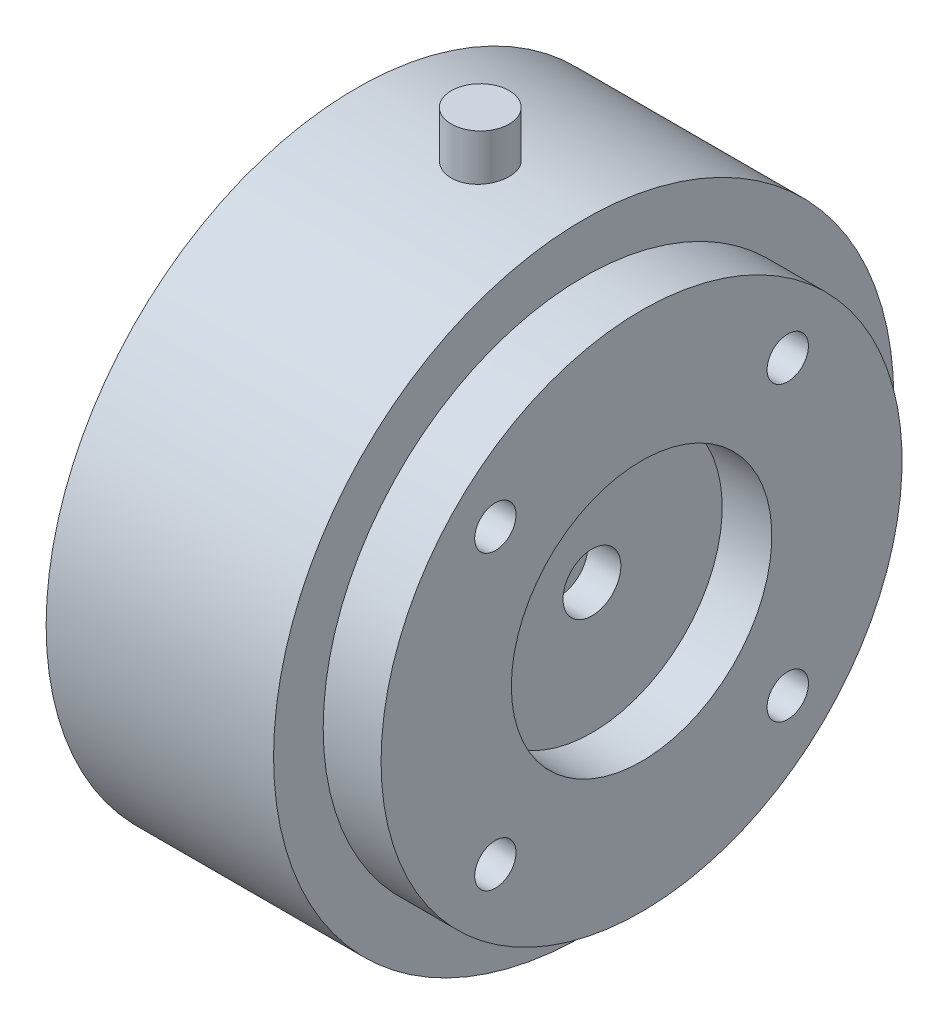
ISO-10303-21;
HEADER;
FILE_DESCRIPTION(('STEP AP214'),'2;1');
FILE_NAME('part.step','',(''),(''),'','','');
FILE_SCHEMA(('AUTOMOTIVE_DESIGN { 1 0 10303 214 1 1 1 1 }'));
ENDSEC;
DATA;
#1=APPLICATION_CONTEXT('core data for automotive mechanical design processes');
#2=APPLICATION_PROTOCOL_DEFINITION('international standard','automotive_design',2000,#1);
#3=PRODUCT_CONTEXT('',#1,'mechanical');
#4=PRODUCT('Part','Part','',(#3));
#5=PRODUCT_RELATED_PRODUCT_CATEGORY('part','',(#4));
#6=PRODUCT_DEFINITION_FORMATION('','',#4);
#7=PRODUCT_DEFINITION_CONTEXT('part definition',#1,'design');
#8=PRODUCT_DEFINITION('design','',#6,#7);
#9=PRODUCT_DEFINITION_SHAPE('','',#8);
#10=(LENGTH_UNIT() NAMED_UNIT(*) SI_UNIT(.MILLI.,.METRE.));
#11=(NAMED_UNIT(*) PLANE_ANGLE_UNIT() SI_UNIT($,.RADIAN.));
#12=(NAMED_UNIT(*) SI_UNIT($,.STERADIAN.) SOLID_ANGLE_UNIT());
#13=UNCERTAINTY_MEASURE_WITH_UNIT(LENGTH_MEASURE(1.E-05),#10,'distance_accuracy_value','');
#14=(GEOMETRIC_REPRESENTATION_CONTEXT(3) GLOBAL_UNCERTAINTY_ASSIGNED_CONTEXT((#13)) GLOBAL_UNIT_ASSIGNED_CONTEXT((#10,
#11,#12)) REPRESENTATION_CONTEXT('',''));
#15=CARTESIAN_POINT('',(0.,0.,0.));
#16=DIRECTION('',(0.,0.,1.));
#17=DIRECTION('',(1.,0.,0.));
#18=AXIS2_PLACEMENT_3D('',#15,#16,#17);
#19=CARTESIAN_POINT('',(24.5,0.,0.));
#20=DIRECTION('',(1.,0.,0.));
#21=DIRECTION('',(0.,0.,-1.));
#22=AXIS2_PLACEMENT_3D('',#19,#20,#21);
#23=PLANE('',#22);
#24=CARTESIAN_POINT('',(24.5,0.,0.));
#25=DIRECTION('',(1.,0.,0.));
#26=DIRECTION('',(0.,0.,-1.));
#27=AXIS2_PLACEMENT_3D('',#24,#25,#26);
#28=CIRCLE('',#27,3.5);
#29=CARTESIAN_POINT('',(24.5,0.,-3.5));
#30=VERTEX_POINT('',#29);
#31=EDGE_CURVE('P0_E385',#30,#30,#28,.T.);
#32=ORIENTED_EDGE('',*,*,#31,.T.);
#33=EDGE_LOOP('',(#32));
#34=FACE_BOUND('',#33,.T.);
#35=ADVANCED_FACE('P0_F17',(#34),#23,.T.);
#36=CARTESIAN_POINT('',(0.,0.,0.));
#37=DIRECTION('',(1.,0.,0.));
#38=DIRECTION('',(0.,0.,-1.));
#39=AXIS2_PLACEMENT_3D('',#36,#37,#38);
#40=CYLINDRICAL_SURFACE('',#39,3.5);
#41=ORIENTED_EDGE('',*,*,#31,.F.);
#42=EDGE_LOOP('',(#41));
#43=FACE_BOUND('',#42,.T.);
#44=CARTESIAN_POINT('',(28.5,0.,0.));
#45=DIRECTION('',(1.,0.,0.));
#46=DIRECTION('',(0.,0.,-1.));
#47=AXIS2_PLACEMENT_3D('',#44,#45,#46);
#48=CIRCLE('',#47,3.5);
#49=CARTESIAN_POINT('',(28.5,0.,-3.5));
#50=VERTEX_POINT('',#49);
#51=EDGE_CURVE('P0_E386',#50,#50,#48,.T.);
#52=ORIENTED_EDGE('',*,*,#51,.T.);
#53=EDGE_LOOP('',(#52));
#54=FACE_BOUND('',#53,.T.);
#55=ADVANCED_FACE('P0_F350',(#43,#54),#40,.F.);
#56=CARTESIAN_POINT('',(28.5,15.75,0.));
#57=DIRECTION('',(-1.,0.,0.));
#58=DIRECTION('',(0.,0.,1.));
#59=AXIS2_PLACEMENT_3D('',#56,#57,#58);
#60=PLANE('',#59);
#61=ORIENTED_EDGE('',*,*,#51,.F.);
#62=EDGE_LOOP('',(#61));
#63=FACE_BOUND('',#62,.T.);
#64=CARTESIAN_POINT('',(28.5,0.,0.));
#65=DIRECTION('',(-1.,0.,0.));
#66=DIRECTION('',(0.,0.,1.));
#67=AXIS2_PLACEMENT_3D('',#64,#65,#66);
#68=CIRCLE('',#67,15.75);
#69=CARTESIAN_POINT('',(28.5,0.,15.75));
#70=VERTEX_POINT('',#69);
#71=EDGE_CURVE('P0_E85',#70,#70,#68,.F.);
#72=ORIENTED_EDGE('',*,*,#71,.T.);
#73=EDGE_LOOP('',(#72));
#74=FACE_BOUND('',#73,.T.);
#75=ADVANCED_FACE('P0_F342',(#63,#74),#60,.F.);
#76=CARTESIAN_POINT('',(26.4999999999418,17.6776695296637,-17.6776695296637));
#77=DIRECTION('',(1.,0.,0.));
#78=DIRECTION('',(0.,0.,-1.));
#79=AXIS2_PLACEMENT_3D('',#76,#77,#78);
#80=CONICAL_SURFACE('',#79,2.49999999979603,1.02974425839346);
#81=CARTESIAN_POINT('',(24.9978484518465,17.6776695296637,-17.67766952955));
#82=VERTEX_POINT('',#81);
#83=VERTEX_LOOP('',#82);
#84=FACE_BOUND('',#83,.T.);
#85=CARTESIAN_POINT('',(26.5,17.6776695296637,-17.6776695296637));
#86=DIRECTION('',(1.,0.,0.));
#87=DIRECTION('',(0.,0.,-1.));
#88=AXIS2_PLACEMENT_3D('',#85,#86,#87);
#89=CIRCLE('',#88,2.5);
#90=CARTESIAN_POINT('',(26.5,17.6776695296637,-20.1776695296637));
#91=VERTEX_POINT('',#90);
#92=EDGE_CURVE('P0_E83',#91,#91,#89,.T.);
#93=ORIENTED_EDGE('',*,*,#92,.T.);
#94=EDGE_LOOP('',(#93));
#95=FACE_BOUND('',#94,.T.);
#96=ADVANCED_FACE('P0_F334',(#84,#95),#80,.F.);
#97=CARTESIAN_POINT('',(26.4999999999418,17.6776695296637,17.6776695296637));
#98=DIRECTION('',(1.,0.,0.));
#99=DIRECTION('',(0.,0.,-1.));
#100=AXIS2_PLACEMENT_3D('',#97,#98,#99);
#101=CONICAL_SURFACE('',#100,2.49999999997205,1.02974425866283);
#102=CARTESIAN_POINT('',(24.9978484523581,17.6776695296637,17.6776695295473));
#103=VERTEX_POINT('',#102);
#104=VERTEX_LOOP('',#103);
#105=FACE_BOUND('',#104,.T.);
#106=CARTESIAN_POINT('',(26.5,17.6776695296637,17.6776695296637));
#107=DIRECTION('',(1.,0.,0.));
#108=DIRECTION('',(0.,0.,-1.));
#109=AXIS2_PLACEMENT_3D('',#106,#107,#108);
#110=CIRCLE('',#109,2.5);
#111=CARTESIAN_POINT('',(26.5,17.6776695296637,15.1776695296637));
#112=VERTEX_POINT('',#111);
#113=EDGE_CURVE('P0_E80',#112,#112,#110,.T.);
#114=ORIENTED_EDGE('',*,*,#113,.T.);
#115=EDGE_LOOP('',(#114));
#116=FACE_BOUND('',#115,.T.);
#117=ADVANCED_FACE('P0_F325',(#105,#116),#101,.F.);
#118=CARTESIAN_POINT('',(26.4999999999418,-17.6776695296638,17.6776695296636));
#119=DIRECTION('',(1.,0.,0.));
#120=DIRECTION('',(0.,1.,0.));
#121=AXIS2_PLACEMENT_3D('',#118,#119,#120);
#122=CONICAL_SURFACE('',#121,2.4999999999721,1.02974425866285);
#123=CARTESIAN_POINT('',(24.9978484523581,-17.6776695296638,17.6776695296636));
#124=VERTEX_POINT('',#123);
#125=VERTEX_LOOP('',#124);
#126=FACE_BOUND('',#125,.T.);
#127=CARTESIAN_POINT('',(26.5,-17.6776695296638,17.6776695296636));
#128=DIRECTION('',(1.,0.,0.));
#129=DIRECTION('',(0.,0.,-1.));
#130=AXIS2_PLACEMENT_3D('',#127,#128,#129);
#131=CIRCLE('',#130,2.5);
#132=CARTESIAN_POINT('',(26.5,-17.6776695296638,15.1776695296636));
#133=VERTEX_POINT('',#132);
#134=EDGE_CURVE('P0_E77',#133,#133,#131,.T.);
#135=ORIENTED_EDGE('',*,*,#134,.T.);
#136=EDGE_LOOP('',(#135));
#137=FACE_BOUND('',#136,.T.);
#138=ADVANCED_FACE('P0_F317',(#126,#137),#122,.F.);
#139=CARTESIAN_POINT('',(26.4999999999418,-17.6776695296635,-17.6776695296638));
#140=DIRECTION('',(1.,0.,0.));
#141=DIRECTION('',(0.,0.,-1.));
#142=AXIS2_PLACEMENT_3D('',#139,#140,#141);
#143=CONICAL_SURFACE('',#142,2.49999999979592,1.02974425851373);
#144=CARTESIAN_POINT('',(24.9978484521876,-17.6776695296635,-17.6776695295786));
#145=VERTEX_POINT('',#144);
#146=VERTEX_LOOP('',#145);
#147=FACE_BOUND('',#146,.T.);
#148=CARTESIAN_POINT('',(26.5,-17.6776695296635,-17.6776695296638));
#149=DIRECTION('',(1.,0.,0.));
#150=DIRECTION('',(0.,0.,-1.));
#151=AXIS2_PLACEMENT_3D('',#148,#149,#150);
#152=CIRCLE('',#151,2.5);
#153=CARTESIAN_POINT('',(26.5,-17.6776695296635,-20.1776695296638));
#154=VERTEX_POINT('',#153);
#155=EDGE_CURVE('P0_E73',#154,#154,#152,.T.);
#156=ORIENTED_EDGE('',*,*,#155,.T.);
#157=EDGE_LOOP('',(#156));
#158=FACE_BOUND('',#157,.T.);
#159=ADVANCED_FACE('P0_F308',(#147,#158),#143,.F.);
#160=CARTESIAN_POINT('',(0.,0.,0.));
#161=DIRECTION('',(-1.,0.,0.));
#162=DIRECTION('',(0.,0.,1.));
#163=AXIS2_PLACEMENT_3D('',#160,#161,#162);
#164=CYLINDRICAL_SURFACE('',#163,15.75);
#165=ORIENTED_EDGE('',*,*,#71,.F.);
#166=EDGE_LOOP('',(#165));
#167=FACE_BOUND('',#166,.T.);
#168=CARTESIAN_POINT('',(34.5,0.,0.));
#169=DIRECTION('',(-1.,0.,0.));
#170=DIRECTION('',(0.,0.,1.));
#171=AXIS2_PLACEMENT_3D('',#168,#169,#170);
#172=CIRCLE('',#171,15.75);
#173=CARTESIAN_POINT('',(34.5,0.,15.75));
#174=VERTEX_POINT('',#173);
#175=EDGE_CURVE('P0_E76',#174,#174,#172,.F.);
#176=ORIENTED_EDGE('',*,*,#175,.T.);
#177=EDGE_LOOP('',(#176));
#178=FACE_BOUND('',#177,.T.);
#179=ADVANCED_FACE('P0_F299',(#167,#178),#164,.F.);
#180=CARTESIAN_POINT('',(34.5,17.6776695296637,-17.6776695296637));
#181=DIRECTION('',(1.,0.,0.));
#182=DIRECTION('',(0.,0.,-1.));
#183=AXIS2_PLACEMENT_3D('',#180,#181,#182);
#184=CYLINDRICAL_SURFACE('',#183,2.5);
#185=ORIENTED_EDGE('',*,*,#92,.F.);
#186=EDGE_LOOP('',(#185));
#187=FACE_BOUND('',#186,.T.);
#188=CARTESIAN_POINT('',(34.5,17.6776695296637,-17.6776695296637));
#189=DIRECTION('',(1.,0.,0.));
#190=DIRECTION('',(0.,0.,-1.));
#191=AXIS2_PLACEMENT_3D('',#188,#189,#190);
#192=CIRCLE('',#191,2.5);
#193=CARTESIAN_POINT('',(34.5,17.6776695296637,-20.1776695296637));
#194=VERTEX_POINT('',#193);
#195=EDGE_CURVE('P0_E402',#194,#194,#192,.T.);
#196=ORIENTED_EDGE('',*,*,#195,.T.);
#197=EDGE_LOOP('',(#196));
#198=FACE_BOUND('',#197,.T.);
#199=ADVANCED_FACE('P0_F290',(#187,#198),#184,.F.);
#200=CARTESIAN_POINT('',(34.5,17.6776695296637,17.6776695296637));
#201=DIRECTION('',(1.,0.,0.));
#202=DIRECTION('',(0.,0.,-1.));
#203=AXIS2_PLACEMENT_3D('',#200,#201,#202);
#204=CYLINDRICAL_SURFACE('',#203,2.5);
#205=ORIENTED_EDGE('',*,*,#113,.F.);
#206=EDGE_LOOP('',(#205));
#207=FACE_BOUND('',#206,.T.);
#208=CARTESIAN_POINT('',(34.5,17.6776695296637,17.6776695296637));
#209=DIRECTION('',(1.,0.,0.));
#210=DIRECTION('',(0.,0.,-1.));
#211=AXIS2_PLACEMENT_3D('',#208,#209,#210);
#212=CIRCLE('',#211,2.5);
#213=CARTESIAN_POINT('',(34.5,17.6776695296637,15.1776695296637));
#214=VERTEX_POINT('',#213);
#215=EDGE_CURVE('P0_E405',#214,#214,#212,.T.);
#216=ORIENTED_EDGE('',*,*,#215,.T.);
#217=EDGE_LOOP('',(#216));
#218=FACE_BOUND('',#217,.T.);
#219=ADVANCED_FACE('P0_F281',(#207,#218),#204,.F.);
#220=CARTESIAN_POINT('',(34.5,-17.6776695296638,17.6776695296636));
#221=DIRECTION('',(1.,0.,0.));
#222=DIRECTION('',(0.,0.,-1.));
#223=AXIS2_PLACEMENT_3D('',#220,#221,#222);
#224=CYLINDRICAL_SURFACE('',#223,2.5);
#225=ORIENTED_EDGE('',*,*,#134,.F.);
#226=EDGE_LOOP('',(#225));
#227=FACE_BOUND('',#226,.T.);
#228=CARTESIAN_POINT('',(34.5,-17.6776695296638,17.6776695296636));
#229=DIRECTION('',(1.,0.,0.));
#230=DIRECTION('',(0.,0.,-1.));
#231=AXIS2_PLACEMENT_3D('',#228,#229,#230);
#232=CIRCLE('',#231,2.5);
#233=CARTESIAN_POINT('',(34.5,-17.6776695296638,15.1776695296636));
#234=VERTEX_POINT('',#233);
#235=EDGE_CURVE('P0_E408',#234,#234,#232,.T.);
#236=ORIENTED_EDGE('',*,*,#235,.T.);
#237=EDGE_LOOP('',(#236));
#238=FACE_BOUND('',#237,.T.);
#239=ADVANCED_FACE('P0_F272',(#227,#238),#224,.F.);
#240=CARTESIAN_POINT('',(34.5,-17.6776695296635,-17.6776695296638));
#241=DIRECTION('',(1.,0.,0.));
#242=DIRECTION('',(0.,0.,-1.));
#243=AXIS2_PLACEMENT_3D('',#240,#241,#242);
#244=CYLINDRICAL_SURFACE('',#243,2.5);
#245=ORIENTED_EDGE('',*,*,#155,.F.);
#246=EDGE_LOOP('',(#245));
#247=FACE_BOUND('',#246,.T.);
#248=CARTESIAN_POINT('',(34.5,-17.6776695296635,-17.6776695296638));
#249=DIRECTION('',(1.,0.,0.));
#250=DIRECTION('',(0.,0.,-1.));
#251=AXIS2_PLACEMENT_3D('',#248,#249,#250);
#252=CIRCLE('',#251,2.5);
#253=CARTESIAN_POINT('',(34.5,-17.6776695296635,-20.1776695296638));
#254=VERTEX_POINT('',#253);
#255=EDGE_CURVE('P0_E411',#254,#254,#252,.T.);
#256=ORIENTED_EDGE('',*,*,#255,.T.);
#257=EDGE_LOOP('',(#256));
#258=FACE_BOUND('',#257,.T.);
#259=ADVANCED_FACE('P0_F263',(#247,#258),#244,.F.);
#260=CARTESIAN_POINT('',(34.5,31.5,0.));
#261=DIRECTION('',(-1.,0.,0.));
#262=DIRECTION('',(0.,0.,1.));
#263=AXIS2_PLACEMENT_3D('',#260,#261,#262);
#264=PLANE('',#263);
#265=ORIENTED_EDGE('',*,*,#255,.F.);
#266=EDGE_LOOP('',(#265));
#267=FACE_BOUND('',#266,.T.);
#268=ORIENTED_EDGE('',*,*,#235,.F.);
#269=EDGE_LOOP('',(#268));
#270=FACE_BOUND('',#269,.T.);
#271=ORIENTED_EDGE('',*,*,#215,.F.);
#272=EDGE_LOOP('',(#271));
#273=FACE_BOUND('',#272,.T.);
#274=ORIENTED_EDGE('',*,*,#195,.F.);
#275=EDGE_LOOP('',(#274));
#276=FACE_BOUND('',#275,.T.);
#277=CARTESIAN_POINT('',(34.5,0.,0.));
#278=DIRECTION('',(-1.,0.,0.));
#279=DIRECTION('',(0.,0.,1.));
#280=AXIS2_PLACEMENT_3D('',#277,#278,#279);
#281=CIRCLE('',#280,31.5);
#282=CARTESIAN_POINT('',(34.5,0.,31.5));
#283=VERTEX_POINT('',#282);
#284=EDGE_CURVE('P0_E414',#283,#283,#281,.T.);
#285=ORIENTED_EDGE('',*,*,#284,.F.);
#286=EDGE_LOOP('',(#285));
#287=FACE_BOUND('',#286,.T.);
#288=ORIENTED_EDGE('',*,*,#175,.F.);
#289=EDGE_LOOP('',(#288));
#290=FACE_BOUND('',#289,.T.);
#291=ADVANCED_FACE('P0_F254',(#267,#270,#273,#276,#287,#290),#264,.F.);
#292=CARTESIAN_POINT('',(110.767027304759,0.,0.));
#293=DIRECTION('',(-1.,0.,0.));
#294=DIRECTION('',(0.,0.,1.));
#295=AXIS2_PLACEMENT_3D('',#292,#293,#294);
#296=CYLINDRICAL_SURFACE('',#295,30.5);
#297=CARTESIAN_POINT('',(15.,30.2985148150862,-3.5));
#298=CARTESIAN_POINT('',(14.8042758081673,30.298517378201,-3.49999145726934));
#299=CARTESIAN_POINT('',(14.608293870057,30.3004332540409,-3.48351415691752));
#300=CARTESIAN_POINT('',(14.2216407698319,30.3078916885357,-3.41800360986984));
#301=CARTESIAN_POINT('',(14.0309815729219,30.3134418242641,-3.3689023422705));
#302=CARTESIAN_POINT('',(13.6608282035903,30.3275322944483,-3.23959657868739));
#303=CARTESIAN_POINT('',(13.4813226802758,30.3360695282893,-3.15942432520621));
#304=CARTESIAN_POINT('',(13.1383989208902,30.3551677477307,-2.97031612135552));
#305=CARTESIAN_POINT('',(12.9749738992356,30.3657278741277,-2.86139237549709));
#306=CARTESIAN_POINT('',(12.6679683388608,30.3877407639857,-2.61729800992369));
#307=CARTESIAN_POINT('',(12.5244766499348,30.3991971892655,-2.48201595110769));
#308=CARTESIAN_POINT('',(12.262174303604,30.4216792291987,-2.18927848624548));
#309=CARTESIAN_POINT('',(12.143366048851,30.4327048018289,-2.03182092416669));
#310=CARTESIAN_POINT('',(11.933506470309,30.4531181691266,-1.69866981088558));
#311=CARTESIAN_POINT('',(11.8425325580965,30.4625013656716,-1.52292719050938));
#312=CARTESIAN_POINT('',(11.6914207964905,30.4785337357317,-1.15853524249233));
#313=CARTESIAN_POINT('',(11.6312817054295,30.4851830193348,-0.96988643490922));
#314=CARTESIAN_POINT('',(11.5438031190628,30.4949733208849,-0.585919982397341));
#315=CARTESIAN_POINT('',(11.516319890356,30.498129708417,-0.390635482220916));
#316=CARTESIAN_POINT('',(11.4944880584397,30.5006309800531,0.00179814922138775));
#317=CARTESIAN_POINT('',(11.5001384034743,30.4999759851414,0.198947221102008));
#318=CARTESIAN_POINT('',(11.5442973977234,30.4949407964535,0.588534530467282));
#319=CARTESIAN_POINT('',(11.5826511809129,30.4905781604075,0.780990580505139));
#320=CARTESIAN_POINT('',(11.690887197553,30.4786377272088,1.15671787386288));
#321=CARTESIAN_POINT('',(11.7607702308364,30.4710598484922,1.33998888404597));
#322=CARTESIAN_POINT('',(11.9302506805374,30.4535100495338,1.69263095242609));
#323=CARTESIAN_POINT('',(12.029916776227,30.4435326064287,1.86196871705036));
#324=CARTESIAN_POINT('',(12.2560755584161,30.42230250347,2.18155900020481));
#325=CARTESIAN_POINT('',(12.3825670921721,30.4110498984224,2.33181233838803));
#326=CARTESIAN_POINT('',(12.6596295929911,30.3884551454816,2.60986627331945));
#327=CARTESIAN_POINT('',(12.8103308143471,30.3771128480346,2.73753708685216));
#328=CARTESIAN_POINT('',(13.1311755677914,30.3556737708395,2.96585046369139));
#329=CARTESIAN_POINT('',(13.3013280060889,30.3455775660804,3.06648057453255));
#330=CARTESIAN_POINT('',(13.6563984290521,30.3277726662424,3.23784902247358));
#331=CARTESIAN_POINT('',(13.8413330236243,30.320066705763,3.30855315570502));
#332=CARTESIAN_POINT('',(14.2203068593126,30.3079568417157,3.41772073943064));
#333=CARTESIAN_POINT('',(14.4143258720931,30.3035459409147,3.45625253020591));
#334=CARTESIAN_POINT('',(14.6747157829135,30.3001908899848,3.48546347914347));
#335=CARTESIAN_POINT('',(14.739643683794,30.2995636448211,3.49091060261971));
#336=CARTESIAN_POINT('',(14.8697048668441,30.2987251806388,3.49818028569412));
#337=CARTESIAN_POINT('',(14.9348381490809,30.2985139617564,3.50000284410494));
#338=CARTESIAN_POINT('',(15.1957241918327,30.298517378201,3.49999145726934));
#339=CARTESIAN_POINT('',(15.391706129943,30.3004332540409,3.48351415691752));
#340=CARTESIAN_POINT('',(15.7783592301681,30.3078916885357,3.41800360986984));
#341=CARTESIAN_POINT('',(15.9690184270781,30.3134418242641,3.3689023422705));
#342=CARTESIAN_POINT('',(16.3391717964097,30.3275322944483,3.23959657868739));
#343=CARTESIAN_POINT('',(16.5186773197242,30.3360695282893,3.15942432520621));
#344=CARTESIAN_POINT('',(16.8616010791098,30.3551677477307,2.97031612135552));
#345=CARTESIAN_POINT('',(17.0250261007644,30.3657278741277,2.86139237549709));
#346=CARTESIAN_POINT('',(17.3320316611392,30.3877407639857,2.61729800992369));
#347=CARTESIAN_POINT('',(17.4755233500652,30.3991971892655,2.48201595110769));
#348=CARTESIAN_POINT('',(17.737825696396,30.4216792291987,2.18927848624548));
#349=CARTESIAN_POINT('',(17.856633951149,30.4327048018289,2.03182092416669));
#350=CARTESIAN_POINT('',(18.066493529691,30.4531181691266,1.69866981088559));
#351=CARTESIAN_POINT('',(18.1574674419035,30.4625013656716,1.52292719050938));
#352=CARTESIAN_POINT('',(18.3085792035095,30.4785337357317,1.15853524249233));
#353=CARTESIAN_POINT('',(18.3687182945705,30.4851830193348,0.969886434909223));
#354=CARTESIAN_POINT('',(18.4561968809372,30.4949733208849,0.585919982397343));
#355=CARTESIAN_POINT('',(18.483680109644,30.498129708417,0.390635482220917));
#356=CARTESIAN_POINT('',(18.5055119415603,30.5006309800531,-0.00179814922138664));
#357=CARTESIAN_POINT('',(18.4998615965257,30.4999759851414,-0.198947221102006));
#358=CARTESIAN_POINT('',(18.4557026022766,30.4949407964535,-0.588534530467279));
#359=CARTESIAN_POINT('',(18.4173488190871,30.4905781604075,-0.780990580505137));
#360=CARTESIAN_POINT('',(18.309112802447,30.4786377272088,-1.15671787386288));
#361=CARTESIAN_POINT('',(18.2392297691636,30.4710598484922,-1.33998888404597));
#362=CARTESIAN_POINT('',(18.0697493194626,30.4535100495338,-1.69263095242608));
#363=CARTESIAN_POINT('',(17.970083223773,30.4435326064287,-1.86196871705036));
#364=CARTESIAN_POINT('',(17.7439244415839,30.42230250347,-2.18155900020481));
#365=CARTESIAN_POINT('',(17.6174329078279,30.4110498984224,-2.33181233838803));
#366=CARTESIAN_POINT('',(17.3403704070089,30.3884551454816,-2.60986627331945));
#367=CARTESIAN_POINT('',(17.1896691856529,30.3771128480346,-2.73753708685216));
#368=CARTESIAN_POINT('',(16.8688244322086,30.3556737708395,-2.96585046369139));
#369=CARTESIAN_POINT('',(16.6986719939111,30.3455775660804,-3.06648057453254));
#370=CARTESIAN_POINT('',(16.3436015709479,30.3277726662424,-3.23784902247358));
#371=CARTESIAN_POINT('',(16.1586669763757,30.320066705763,-3.30855315570502));
#372=CARTESIAN_POINT('',(15.7796931406875,30.3079568417157,-3.41772073943064));
#373=CARTESIAN_POINT('',(15.5856741279069,30.3035459409147,-3.45625253020592));
#374=CARTESIAN_POINT('',(15.3252842170865,30.3001908899848,-3.48546347914347));
#375=CARTESIAN_POINT('',(15.260356316206,30.2995636448211,-3.49091060261971));
#376=CARTESIAN_POINT('',(15.1302951331559,30.2987251806388,-3.49818028569412));
#377=CARTESIAN_POINT('',(15.0651618509191,30.2985139617564,-3.50000284410494));
#378=CARTESIAN_POINT('',(15.,30.2985148150862,-3.5));
#379=B_SPLINE_CURVE_WITH_KNOTS('',3,(#297,#298,#299,#300,#301,#302,#303,#304,#305,#306,#307,
#308,#309,#310,#311,#312,#313,#314,#315,#316,#317,#318,#319,#320,#321,#322,#323,#324,#325,#326,
#327,#328,#329,#330,#331,#332,#333,#334,#335,#336,#337,#338,#339,#340,#341,#342,#343,#344,#345,
#346,#347,#348,#349,#350,#351,#352,#353,#354,#355,#356,#357,#358,#359,#360,#361,#362,#363,#364,
#365,#366,#367,#368,#369,#370,#371,#372,#373,#374,#375,#376,#377,#378),.UNSPECIFIED.,.T.,.F.,(4,
2,2,2,2,2,2,2,2,2,2,2,2,2,2,2,2,2,2,2,2,2,2,2,2,2,2,2,2,2,2,2,2,2,2,2,2,2,2,2,4),(0.,
0.586924300188883,1.17507619265083,1.76261938441853,2.34991357422254,2.93974685655111,
3.52963752557404,4.12115416296189,4.71264697907599,5.301526605123,5.89038753852025,
6.47647532939777,7.06257798896397,7.65004276072639,8.23748229304951,8.82819532080955,
9.41917991237897,10.010838157074,10.6012363845076,10.7966392157223,10.9920421109474,
11.5789664111363,12.1671183035983,12.754661495366,13.34195568517,13.9317889674985,
14.5216796365215,15.1131962739093,15.7046890900234,16.2935687160704,16.8824296494677,
17.4685174403452,18.0546200999114,18.6420848716738,19.2295244039969,19.820237431757,
20.4112220233264,21.0028802680214,21.593278495455,21.7886813266698,21.9840842218949),.UNSPECIFIED.);
#380=CARTESIAN_POINT('',(15.,30.2985148150862,-3.5));
#381=VERTEX_POINT('',#380);
#382=EDGE_CURVE('P0_E416',#381,#381,#379,.T.);
#383=ORIENTED_EDGE('',*,*,#382,.T.);
#384=EDGE_LOOP('',(#383));
#385=FACE_BOUND('',#384,.T.);
#386=ADVANCED_FACE('P0_F246',(#385),#296,.T.);
#387=CARTESIAN_POINT('',(0.,0.,0.));
#388=DIRECTION('',(-1.,0.,0.));
#389=DIRECTION('',(0.,0.,1.));
#390=AXIS2_PLACEMENT_3D('',#387,#388,#389);
#391=CYLINDRICAL_SURFACE('',#390,31.5);
#392=ORIENTED_EDGE('',*,*,#284,.T.);
#393=EDGE_LOOP('',(#392));
#394=FACE_BOUND('',#393,.T.);
#395=CARTESIAN_POINT('',(27.5,0.,0.));
#396=DIRECTION('',(-1.,0.,0.));
#397=DIRECTION('',(0.,0.,1.));
#398=AXIS2_PLACEMENT_3D('',#395,#396,#397);
#399=CIRCLE('',#398,31.5);
#400=CARTESIAN_POINT('',(27.5,0.,31.5));
#401=VERTEX_POINT('',#400);
#402=EDGE_CURVE('P0_E96',#401,#401,#399,.F.);
#403=ORIENTED_EDGE('',*,*,#402,.T.);
#404=EDGE_LOOP('',(#403));
#405=FACE_BOUND('',#404,.T.);
#406=ADVANCED_FACE('P0_F116',(#394,#405),#391,.T.);
#407=CARTESIAN_POINT('',(15.,37.5,0.));
#408=DIRECTION('',(0.,-1.,0.));
#409=DIRECTION('',(0.,0.,-1.));
#410=AXIS2_PLACEMENT_3D('',#407,#408,#409);
#411=CYLINDRICAL_SURFACE('',#410,3.5);
#412=ORIENTED_EDGE('',*,*,#382,.F.);
#413=EDGE_LOOP('',(#412));
#414=FACE_BOUND('',#413,.T.);
#415=CARTESIAN_POINT('',(15.,37.3363094051889,3.5));
#416=CARTESIAN_POINT('',(14.8040356546836,37.3363114581779,3.49999159976147));
#417=CARTESIAN_POINT('',(14.6078108510814,37.3378699743436,3.48347414309542));
#418=CARTESIAN_POINT('',(14.2206662319479,37.3439381541415,3.41779635529493));
#419=CARTESIAN_POINT('',(14.0297584770961,37.3484540346556,3.36856725553234));
#420=CARTESIAN_POINT('',(13.6591047581185,37.3599213532937,3.23890177151375));
#421=CARTESIAN_POINT('',(13.4793481849901,37.3668704333545,3.1584955935267));
#422=CARTESIAN_POINT('',(13.135970562157,37.3824176383386,2.96881481261273));
#423=CARTESIAN_POINT('',(12.9723424418788,37.3910150357417,2.85955293776334));
#424=CARTESIAN_POINT('',(12.6652349406536,37.4089230033886,2.61486659417071));
#425=CARTESIAN_POINT('',(12.5218158616421,37.4182355850682,2.47936657463364));
#426=CARTESIAN_POINT('',(12.2597132336003,37.4365066736323,2.1862053535238));
#427=CARTESIAN_POINT('',(12.1410319960815,37.4454651473656,2.02854208331272));
#428=CARTESIAN_POINT('',(11.9315855414435,37.4620368979857,1.69518417705754));
#429=CARTESIAN_POINT('',(11.8408710104555,37.4696477219284,1.51945756287206));
#430=CARTESIAN_POINT('',(11.6902584131925,37.482645682227,1.15518511728848));
#431=CARTESIAN_POINT('',(11.6303594163984,37.4880328857272,0.966639673167977));
#432=CARTESIAN_POINT('',(11.5432468661134,37.4959630819518,0.582666348263729));
#433=CARTESIAN_POINT('',(11.5159380514922,37.4985143625747,0.387260253394456));
#434=CARTESIAN_POINT('',(11.4944864434938,37.5005134027287,-0.00537773248790604));
#435=CARTESIAN_POINT('',(11.5003429514608,37.4999612276368,-0.202609584952466));
#436=CARTESIAN_POINT('',(11.5449780751454,37.4958223841303,-0.592651845396382));
#437=CARTESIAN_POINT('',(11.5836539539394,37.4922451852938,-0.785474124760561));
#438=CARTESIAN_POINT('',(11.6926706451641,37.4824692916633,-1.16188026092169));
#439=CARTESIAN_POINT('',(11.7630121132133,37.4762705425918,-1.34546392635076));
#440=CARTESIAN_POINT('',(11.933479471107,37.4619321209238,-1.69851073715258));
#441=CARTESIAN_POINT('',(12.0336520733446,37.4537894082822,-1.86795119902822));
#442=CARTESIAN_POINT('',(12.2608953181714,37.4364782470949,-2.1876388360249));
#443=CARTESIAN_POINT('',(12.387964414117,37.4273098575436,-2.33788711396824));
#444=CARTESIAN_POINT('',(12.6659461822893,37.4089367108281,-2.61551577028369));
#445=CARTESIAN_POINT('',(12.816943545917,37.3997319422155,-2.74281135319782));
#446=CARTESIAN_POINT('',(13.1382924676749,37.3823522474711,-2.97032126317762));
#447=CARTESIAN_POINT('',(13.3086529719222,37.3741778010752,-3.07052299956905));
#448=CARTESIAN_POINT('',(13.6639991213441,37.359782587258,-3.240987496695));
#449=CARTESIAN_POINT('',(13.8489991360946,37.3535637699405,-3.3112203980125));
#450=CARTESIAN_POINT('',(14.2279833006619,37.3438123278045,-3.419455935303));
#451=CARTESIAN_POINT('',(14.4219474524401,37.3402740034854,-3.45752697663121));
#452=CARTESIAN_POINT('',(14.6809971292402,37.3376175073627,-3.48602054515327));
#453=CARTESIAN_POINT('',(14.7446764902426,37.3371279469485,-3.49125901470397));
#454=CARTESIAN_POINT('',(14.8722280028489,37.3364735611131,-3.49825011202207));
#455=CARTESIAN_POINT('',(14.9361001544887,37.3363087357525,-3.50000273914085));
#456=CARTESIAN_POINT('',(15.1959643453164,37.3363114581779,-3.49999159976147));
#457=CARTESIAN_POINT('',(15.3921891489186,37.3378699743436,-3.48347414309542));
#458=CARTESIAN_POINT('',(15.7793337680521,37.3439381541415,-3.41779635529493));
#459=CARTESIAN_POINT('',(15.9702415229039,37.3484540346556,-3.36856725553234));
#460=CARTESIAN_POINT('',(16.3408952418815,37.3599213532937,-3.23890177151375));
#461=CARTESIAN_POINT('',(16.5206518150099,37.3668704333545,-3.1584955935267));
#462=CARTESIAN_POINT('',(16.864029437843,37.3824176383386,-2.96881481261273));
#463=CARTESIAN_POINT('',(17.0276575581212,37.3910150357417,-2.85955293776334));
#464=CARTESIAN_POINT('',(17.3347650593464,37.4089230033886,-2.61486659417071));
#465=CARTESIAN_POINT('',(17.4781841383579,37.4182355850682,-2.47936657463364));
#466=CARTESIAN_POINT('',(17.7402867663997,37.4365066736323,-2.1862053535238));
#467=CARTESIAN_POINT('',(17.8589680039185,37.4454651473656,-2.02854208331272));
#468=CARTESIAN_POINT('',(18.0684144585565,37.4620368979857,-1.69518417705755));
#469=CARTESIAN_POINT('',(18.1591289895445,37.4696477219285,-1.51945756287206));
#470=CARTESIAN_POINT('',(18.3097415868075,37.482645682227,-1.15518511728849));
#471=CARTESIAN_POINT('',(18.3696405836016,37.4880328857272,-0.966639673167981));
#472=CARTESIAN_POINT('',(18.4567531338866,37.4959630819518,-0.582666348263732));
#473=CARTESIAN_POINT('',(18.4840619485078,37.4985143625747,-0.387260253394459));
#474=CARTESIAN_POINT('',(18.5055135565062,37.5005134027287,0.00537773248790343));
#475=CARTESIAN_POINT('',(18.4996570485392,37.4999612276368,0.202609584952463));
#476=CARTESIAN_POINT('',(18.4550219248546,37.4958223841303,0.592651845396379));
#477=CARTESIAN_POINT('',(18.4163460460606,37.4922451852938,0.785474124760557));
#478=CARTESIAN_POINT('',(18.3073293548359,37.4824692916633,1.16188026092169));
#479=CARTESIAN_POINT('',(18.2369878867867,37.4762705425918,1.34546392635076));
#480=CARTESIAN_POINT('',(18.066520528893,37.4619321209238,1.69851073715258));
#481=CARTESIAN_POINT('',(17.9663479266554,37.4537894082822,1.86795119902822));
#482=CARTESIAN_POINT('',(17.7391046818286,37.4364782470949,2.1876388360249));
#483=CARTESIAN_POINT('',(17.612035585883,37.4273098575436,2.33788711396824));
#484=CARTESIAN_POINT('',(17.3340538177107,37.4089367108281,2.61551577028369));
#485=CARTESIAN_POINT('',(17.183056454083,37.3997319422155,2.74281135319781));
#486=CARTESIAN_POINT('',(16.8617075323251,37.3823522474711,2.97032126317762));
#487=CARTESIAN_POINT('',(16.6913470280778,37.3741778010752,3.07052299956905));
#488=CARTESIAN_POINT('',(16.3360008786559,37.359782587258,3.240987496695));
#489=CARTESIAN_POINT('',(16.1510008639054,37.3535637699405,3.3112203980125));
#490=CARTESIAN_POINT('',(15.7720166993381,37.3438123278045,3.419455935303));
#491=CARTESIAN_POINT('',(15.5780525475599,37.3402740034854,3.45752697663121));
#492=CARTESIAN_POINT('',(15.3190028707598,37.3376175073627,3.48602054515327));
#493=CARTESIAN_POINT('',(15.2553235097574,37.3371279469485,3.49125901470397));
#494=CARTESIAN_POINT('',(15.1277719971511,37.3364735611131,3.49825011202207));
#495=CARTESIAN_POINT('',(15.0638998455113,37.3363087357525,3.50000273914085));
#496=CARTESIAN_POINT('',(15.,37.3363094051889,3.5));
#497=B_SPLINE_CURVE_WITH_KNOTS('',3,(#415,#416,#417,#418,#419,#420,#421,#422,#423,#424,#425,
#426,#427,#428,#429,#430,#431,#432,#433,#434,#435,#436,#437,#438,#439,#440,#441,#442,#443,#444,
#445,#446,#447,#448,#449,#450,#451,#452,#453,#454,#455,#456,#457,#458,#459,#460,#461,#462,#463,
#464,#465,#466,#467,#468,#469,#470,#471,#472,#473,#474,#475,#476,#477,#478,#479,#480,#481,#482,
#483,#484,#485,#486,#487,#488,#489,#490,#491,#492,#493,#494,#495,#496),.UNSPECIFIED.,.T.,.F.,(4,
2,2,2,2,2,2,2,2,2,2,2,2,2,2,2,2,2,2,2,2,2,2,2,2,2,2,2,2,2,2,2,2,2,2,2,2,2,2,2,4),(0.,
0.587649724148832,1.17653877041978,1.76485868472883,2.35291952676917,2.94269952541401,
3.53253460860344,4.12343249304263,4.71431253342716,5.30346116721982,5.89259739013869,
6.47989617052857,7.06720711117352,7.65544259808876,8.24364426856452,8.83397632780462,
9.42458224827805,10.01577525205,10.60570765334,10.7973278153648,10.9889480130453,
11.5765977371941,12.165486783465,12.7538066977741,13.3418675398144,13.9316475384593,
14.5214826216487,15.1123805060879,15.7032605464724,16.2924091802651,16.8815454031839,
17.4688441835738,18.0561551242188,18.644390611134,19.2325922816098,19.8229243408499,
20.4135302613233,21.0047232650952,21.5946556663852,21.78627582841,21.9778960260905),.UNSPECIFIED.);
#498=CARTESIAN_POINT('',(15.,37.3363094051889,3.5));
#499=VERTEX_POINT('',#498);
#500=EDGE_CURVE('P0_E89',#499,#499,#497,.T.);
#501=ORIENTED_EDGE('',*,*,#500,.F.);
#502=EDGE_LOOP('',(#501));
#503=FACE_BOUND('',#502,.T.);
#504=ADVANCED_FACE('P0_F98',(#414,#503),#411,.F.);
#505=CARTESIAN_POINT('',(27.5,37.5,0.));
#506=DIRECTION('',(-1.,0.,0.));
#507=DIRECTION('',(0.,0.,1.));
#508=AXIS2_PLACEMENT_3D('',#505,#506,#507);
#509=PLANE('',#508);
#510=CARTESIAN_POINT('',(27.5,0.,0.));
#511=DIRECTION('',(-1.,0.,0.));
#512=DIRECTION('',(0.,0.,1.));
#513=AXIS2_PLACEMENT_3D('',#510,#511,#512);
#514=CIRCLE('',#513,37.5);
#515=CARTESIAN_POINT('',(27.5,0.,37.5));
#516=VERTEX_POINT('',#515);
#517=EDGE_CURVE('P0_E26',#516,#516,#514,.T.);
#518=ORIENTED_EDGE('',*,*,#517,.F.);
#519=EDGE_LOOP('',(#518));
#520=FACE_BOUND('',#519,.T.);
#521=ORIENTED_EDGE('',*,*,#402,.F.);
#522=EDGE_LOOP('',(#521));
#523=FACE_BOUND('',#522,.T.);
#524=ADVANCED_FACE('P0_F107',(#520,#523),#509,.F.);
#525=CARTESIAN_POINT('',(0.,0.,0.));
#526=DIRECTION('',(-1.,0.,0.));
#527=DIRECTION('',(0.,0.,1.));
#528=AXIS2_PLACEMENT_3D('',#525,#526,#527);
#529=CYLINDRICAL_SURFACE('',#528,37.5);
#530=ORIENTED_EDGE('',*,*,#517,.T.);
#531=EDGE_LOOP('',(#530));
#532=FACE_BOUND('',#531,.T.);
#533=CARTESIAN_POINT('',(0.,0.,0.));
#534=DIRECTION('',(-1.,0.,0.));
#535=DIRECTION('',(0.,0.,1.));
#536=AXIS2_PLACEMENT_3D('',#533,#534,#535);
#537=CIRCLE('',#536,37.5);
#538=CARTESIAN_POINT('',(0.,0.,37.5));
#539=VERTEX_POINT('',#538);
#540=EDGE_CURVE('P0_E11',#539,#539,#537,.F.);
#541=ORIENTED_EDGE('',*,*,#540,.T.);
#542=EDGE_LOOP('',(#541));
#543=FACE_BOUND('',#542,.T.);
#544=ORIENTED_EDGE('',*,*,#500,.T.);
#545=EDGE_LOOP('',(#544));
#546=FACE_BOUND('',#545,.T.);
#547=ADVANCED_FACE('P0_F102',(#532,#543,#546),#529,.T.);
#548=CARTESIAN_POINT('',(0.,37.5,0.));
#549=DIRECTION('',(1.,0.,0.));
#550=DIRECTION('',(0.,0.,-1.));
#551=AXIS2_PLACEMENT_3D('',#548,#549,#550);
#552=PLANE('',#551);
#553=ORIENTED_EDGE('',*,*,#540,.F.);
#554=EDGE_LOOP('',(#553));
#555=FACE_BOUND('',#554,.T.);
#556=ADVANCED_FACE('P0_F106',(#555),#552,.F.);
#557=CLOSED_SHELL('',(#35,#55,#75,#96,#117,#138,#159,#179,#199,#219,#239,#259,#291,#386,#406,
#504,#524,#547,#556));
#558=CARTESIAN_POINT('',(32.9999999999586,-22.,0.));
#559=DIRECTION('',(-1.,0.,0.));
#560=DIRECTION('',(0.,0.,1.));
#561=AXIS2_PLACEMENT_3D('',#558,#559,#560);
#562=CONICAL_SURFACE('',#561,1.25000000008413,1.0297442585817);
#563=CARTESIAN_POINT('',(33.7510757739494,-22.,-5.6843418860808E-11));
#564=VERTEX_POINT('',#563);
#565=VERTEX_LOOP('',#564);
#566=FACE_BOUND('',#565,.T.);
#567=CARTESIAN_POINT('',(33.,-22.,0.));
#568=DIRECTION('',(-1.,0.,0.));
#569=DIRECTION('',(0.,0.,1.));
#570=AXIS2_PLACEMENT_3D('',#567,#568,#569);
#571=CIRCLE('',#570,1.25);
#572=CARTESIAN_POINT('',(33.,-22.,1.25));
#573=VERTEX_POINT('',#572);
#574=EDGE_CURVE('P0_E69',#573,#573,#571,.T.);
#575=ORIENTED_EDGE('',*,*,#574,.T.);
#576=EDGE_LOOP('',(#575));
#577=FACE_BOUND('',#576,.T.);
#578=ADVANCED_FACE('P0_F137',(#566,#577),#562,.F.);
#579=CARTESIAN_POINT('',(24.5,0.,0.));
#580=DIRECTION('',(1.,0.,0.));
#581=DIRECTION('',(0.,0.,-1.));
#582=AXIS2_PLACEMENT_3D('',#579,#580,#581);
#583=PLANE('',#582);
#584=CARTESIAN_POINT('',(24.5,-22.,0.));
#585=DIRECTION('',(-1.,0.,0.));
#586=DIRECTION('',(0.,0.,1.));
#587=AXIS2_PLACEMENT_3D('',#584,#585,#586);
#588=CIRCLE('',#587,1.25);
#589=CARTESIAN_POINT('',(24.5,-22.,1.25));
#590=VERTEX_POINT('',#589);
#591=EDGE_CURVE('P0_E72',#590,#590,#588,.F.);
#592=ORIENTED_EDGE('',*,*,#591,.T.);
#593=EDGE_LOOP('',(#592));
#594=FACE_BOUND('',#593,.T.);
#595=ADVANCED_FACE('P0_F140',(#594),#583,.T.);
#596=CARTESIAN_POINT('',(24.5,-22.,0.));
#597=DIRECTION('',(-1.,0.,0.));
#598=DIRECTION('',(0.,0.,1.));
#599=AXIS2_PLACEMENT_3D('',#596,#597,#598);
#600=CYLINDRICAL_SURFACE('',#599,1.25);
#601=ORIENTED_EDGE('',*,*,#591,.F.);
#602=EDGE_LOOP('',(#601));
#603=FACE_BOUND('',#602,.T.);
#604=ORIENTED_EDGE('',*,*,#574,.F.);
#605=EDGE_LOOP('',(#604));
#606=FACE_BOUND('',#605,.T.);
#607=ADVANCED_FACE('P0_F147',(#603,#606),#600,.F.);
#608=CLOSED_SHELL('',(#578,#595,#607));
#609=CARTESIAN_POINT('',(33.0000000000155,11.0000000000001,-19.0525588832576));
#610=DIRECTION('',(-1.,0.,0.));
#611=DIRECTION('',(0.,0.,1.));
#612=AXIS2_PLACEMENT_3D('',#609,#610,#611);
#613=CONICAL_SURFACE('',#612,1.25000000011019,1.02974425812561);
#614=CARTESIAN_POINT('',(33.75107577466,11.0000000000001,-19.0525588831747));
#615=VERTEX_POINT('',#614);
#616=VERTEX_LOOP('',#615);
#617=FACE_BOUND('',#616,.T.);
#618=CARTESIAN_POINT('',(33.,11.0000000000001,-19.0525588832576));
#619=DIRECTION('',(-1.,0.,0.));
#620=DIRECTION('',(0.,0.,1.));
#621=AXIS2_PLACEMENT_3D('',#618,#619,#620);
#622=CIRCLE('',#621,1.25);
#623=CARTESIAN_POINT('',(33.,11.0000000000001,-17.8025588832576));
#624=VERTEX_POINT('',#623);
#625=EDGE_CURVE('P0_E64',#624,#624,#622,.T.);
#626=ORIENTED_EDGE('',*,*,#625,.T.);
#627=EDGE_LOOP('',(#626));
#628=FACE_BOUND('',#627,.T.);
#629=ADVANCED_FACE('P0_F160',(#617,#628),#613,.F.);
#630=CARTESIAN_POINT('',(24.5,0.,0.));
#631=DIRECTION('',(1.,0.,0.));
#632=DIRECTION('',(0.,0.,-1.));
#633=AXIS2_PLACEMENT_3D('',#630,#631,#632);
#634=PLANE('',#633);
#635=CARTESIAN_POINT('',(24.5,11.0000000000001,-19.0525588832576));
#636=DIRECTION('',(-1.,0.,0.));
#637=DIRECTION('',(0.,0.,1.));
#638=AXIS2_PLACEMENT_3D('',#635,#636,#637);
#639=CIRCLE('',#638,1.25);
#640=CARTESIAN_POINT('',(24.5,11.0000000000001,-17.8025588832576));
#641=VERTEX_POINT('',#640);
#642=EDGE_CURVE('P0_E68',#641,#641,#639,.F.);
#643=ORIENTED_EDGE('',*,*,#642,.T.);
#644=EDGE_LOOP('',(#643));
#645=FACE_BOUND('',#644,.T.);
#646=ADVANCED_FACE('P0_F163',(#645),#634,.T.);
#647=CARTESIAN_POINT('',(24.5,11.0000000000001,-19.0525588832576));
#648=DIRECTION('',(-1.,0.,0.));
#649=DIRECTION('',(0.,0.,1.));
#650=AXIS2_PLACEMENT_3D('',#647,#648,#649);
#651=CYLINDRICAL_SURFACE('',#650,1.25);
#652=ORIENTED_EDGE('',*,*,#642,.F.);
#653=EDGE_LOOP('',(#652));
#654=FACE_BOUND('',#653,.T.);
#655=ORIENTED_EDGE('',*,*,#625,.F.);
#656=EDGE_LOOP('',(#655));
#657=FACE_BOUND('',#656,.T.);
#658=ADVANCED_FACE('P0_F172',(#654,#657),#651,.F.);
#659=CLOSED_SHELL('',(#629,#646,#658));
#660=CARTESIAN_POINT('',(33.0000000000723,10.9999999999998,19.0525588832577));
#661=DIRECTION('',(-1.,0.,0.));
#662=DIRECTION('',(0.,0.,1.));
#663=AXIS2_PLACEMENT_3D('',#660,#661,#662);
#664=CONICAL_SURFACE('',#663,1.25000000011476,1.02974425805527);
#665=CARTESIAN_POINT('',(33.7510757747452,10.9999999999998,19.0525588835158));
#666=VERTEX_POINT('',#665);
#667=VERTEX_LOOP('',#666);
#668=FACE_BOUND('',#667,.T.);
#669=CARTESIAN_POINT('',(33.,10.9999999999998,19.0525588832577));
#670=DIRECTION('',(-1.,0.,0.));
#671=DIRECTION('',(0.,0.,1.));
#672=AXIS2_PLACEMENT_3D('',#669,#670,#671);
#673=CIRCLE('',#672,1.25);
#674=CARTESIAN_POINT('',(33.,10.9999999999998,20.3025588832577));
#675=VERTEX_POINT('',#674);
#676=EDGE_CURVE('P0_E60',#675,#675,#673,.T.);
#677=ORIENTED_EDGE('',*,*,#676,.T.);
#678=EDGE_LOOP('',(#677));
#679=FACE_BOUND('',#678,.T.);
#680=ADVANCED_FACE('P0_F51',(#668,#679),#664,.F.);
#681=CARTESIAN_POINT('',(24.5,0.,0.));
#682=DIRECTION('',(1.,0.,0.));
#683=DIRECTION('',(0.,0.,-1.));
#684=AXIS2_PLACEMENT_3D('',#681,#682,#683);
#685=PLANE('',#684);
#686=CARTESIAN_POINT('',(24.5,10.9999999999998,19.0525588832577));
#687=DIRECTION('',(-1.,0.,0.));
#688=DIRECTION('',(0.,0.,1.));
#689=AXIS2_PLACEMENT_3D('',#686,#687,#688);
#690=CIRCLE('',#689,1.25);
#691=CARTESIAN_POINT('',(24.5,10.9999999999998,20.3025588832577));
#692=VERTEX_POINT('',#691);
#693=EDGE_CURVE('P0_E20',#692,#692,#690,.F.);
#694=ORIENTED_EDGE('',*,*,#693,.T.);
#695=EDGE_LOOP('',(#694));
#696=FACE_BOUND('',#695,.T.);
#697=ADVANCED_FACE('P0_F54',(#696),#685,.T.);
#698=CARTESIAN_POINT('',(24.5,10.9999999999998,19.0525588832577));
#699=DIRECTION('',(-1.,0.,0.));
#700=DIRECTION('',(0.,0.,1.));
#701=AXIS2_PLACEMENT_3D('',#698,#699,#700);
#702=CYLINDRICAL_SURFACE('',#701,1.25);
#703=ORIENTED_EDGE('',*,*,#693,.F.);
#704=EDGE_LOOP('',(#703));
#705=FACE_BOUND('',#704,.T.);
#706=ORIENTED_EDGE('',*,*,#676,.F.);
#707=EDGE_LOOP('',(#706));
#708=FACE_BOUND('',#707,.T.);
#709=ADVANCED_FACE('P0_F191',(#705,#708),#702,.F.);
#710=CLOSED_SHELL('',(#680,#697,#709));
#711=ORIENTED_CLOSED_SHELL('',*,#608,.T.);
#712=ORIENTED_CLOSED_SHELL('',*,#659,.T.);
#713=ORIENTED_CLOSED_SHELL('',*,#710,.T.);
#714=BREP_WITH_VOIDS('P0_B1',#557,(#711,#712,#713));
#715=CARTESIAN_POINT('',(15.,43.,0.));
#716=DIRECTION('',(0.,1.,0.));
#717=DIRECTION('',(0.,0.,1.));
#718=AXIS2_PLACEMENT_3D('',#715,#716,#717);
#719=PLANE('',#718);
#720=CARTESIAN_POINT('',(15.,43.,0.));
#721=DIRECTION('',(0.,-1.,0.));
#722=DIRECTION('',(0.,0.,-1.));
#723=AXIS2_PLACEMENT_3D('',#720,#721,#722);
#724=CIRCLE('',#723,3.5);
#725=CARTESIAN_POINT('',(15.,43.,-3.5));
#726=VERTEX_POINT('',#725);
#727=EDGE_CURVE('P1_E17',#726,#726,#724,.T.);
#728=ORIENTED_EDGE('',*,*,#727,.F.);
#729=EDGE_LOOP('',(#728));
#730=FACE_BOUND('',#729,.T.);
#731=ADVANCED_FACE('P1_F14',(#730),#719,.T.);
#732=CARTESIAN_POINT('',(15.,0.,0.));
#733=DIRECTION('',(0.,1.,0.));
#734=DIRECTION('',(0.,0.,1.));
#735=AXIS2_PLACEMENT_3D('',#732,#733,#734);
#736=PLANE('',#735);
#737=CARTESIAN_POINT('',(15.,0.,0.));
#738=DIRECTION('',(0.,-1.,0.));
#739=DIRECTION('',(0.,0.,-1.));
#740=AXIS2_PLACEMENT_3D('',#737,#738,#739);
#741=CIRCLE('',#740,3.5);
#742=CARTESIAN_POINT('',(15.,0.,-3.5));
#743=VERTEX_POINT('',#742);
#744=EDGE_CURVE('P1_E10',#743,#743,#741,.F.);
#745=ORIENTED_EDGE('',*,*,#744,.F.);
#746=EDGE_LOOP('',(#745));
#747=FACE_BOUND('',#746,.T.);
#748=ADVANCED_FACE('P1_F29',(#747),#736,.F.);
#749=CARTESIAN_POINT('',(15.,43.,0.));
#750=DIRECTION('',(0.,-1.,0.));
#751=DIRECTION('',(0.,0.,-1.));
#752=AXIS2_PLACEMENT_3D('',#749,#750,#751);
#753=CYLINDRICAL_SURFACE('',#752,3.5);
#754=ORIENTED_EDGE('',*,*,#744,.T.);
#755=EDGE_LOOP('',(#754));
#756=FACE_BOUND('',#755,.T.);
#757=ORIENTED_EDGE('',*,*,#727,.T.);
#758=EDGE_LOOP('',(#757));
#759=FACE_BOUND('',#758,.T.);
#760=ADVANCED_FACE('P1_F26',(#756,#759),#753,.T.);
#761=CLOSED_SHELL('',(#731,#748,#760));
#762=MANIFOLD_SOLID_BREP('P1_B1',#761);
#763=ADVANCED_BREP_SHAPE_REPRESENTATION('',(#18,#714,#762),#14);
#764=SHAPE_DEFINITION_REPRESENTATION(#9,#763);
ENDSEC;
END-ISO-10303-21;
